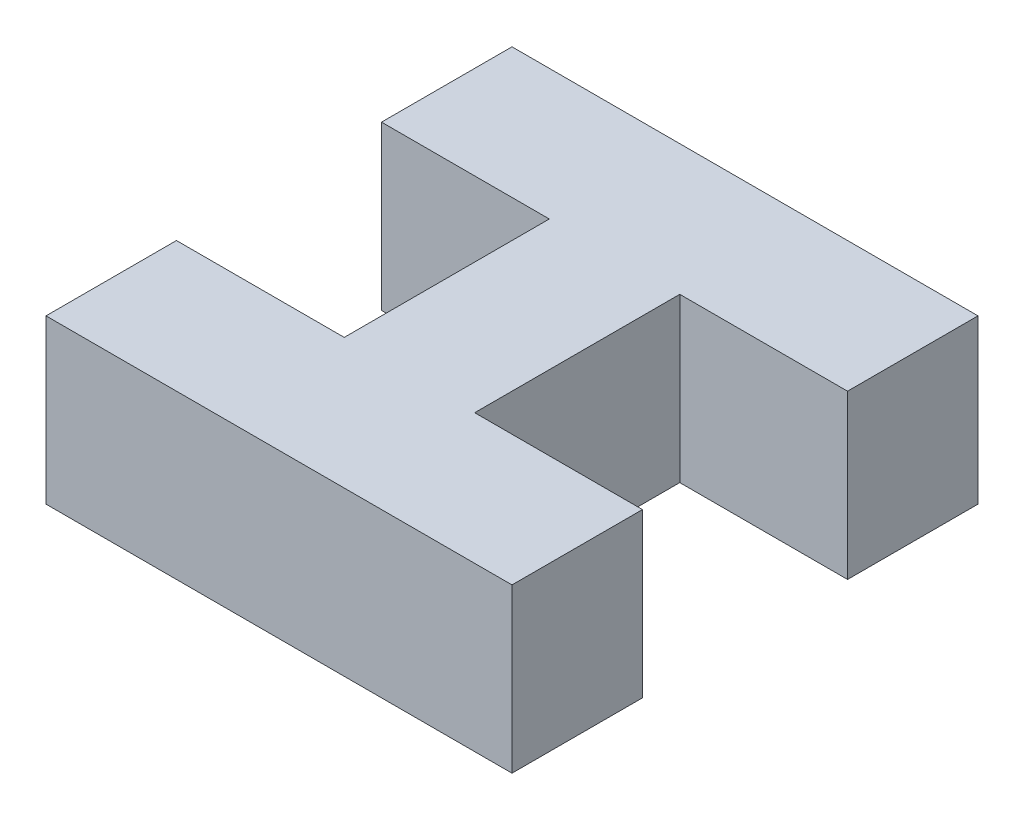
ISO-10303-21;
HEADER;
FILE_DESCRIPTION(('STEP AP214'),'2;1');
FILE_NAME('part.step','',(''),(''),'','','');
FILE_SCHEMA(('AUTOMOTIVE_DESIGN { 1 0 10303 214 1 1 1 1 }'));
ENDSEC;
DATA;
#1=APPLICATION_CONTEXT('core data for automotive mechanical design processes');
#2=APPLICATION_PROTOCOL_DEFINITION('international standard','automotive_design',2000,#1);
#3=PRODUCT_CONTEXT('',#1,'mechanical');
#4=PRODUCT('Part','Part','',(#3));
#5=PRODUCT_RELATED_PRODUCT_CATEGORY('part','',(#4));
#6=PRODUCT_DEFINITION_FORMATION('','',#4);
#7=PRODUCT_DEFINITION_CONTEXT('part definition',#1,'design');
#8=PRODUCT_DEFINITION('design','',#6,#7);
#9=PRODUCT_DEFINITION_SHAPE('','',#8);
#10=(LENGTH_UNIT() NAMED_UNIT(*) SI_UNIT(.MILLI.,.METRE.));
#11=(NAMED_UNIT(*) PLANE_ANGLE_UNIT() SI_UNIT($,.RADIAN.));
#12=(NAMED_UNIT(*) SI_UNIT($,.STERADIAN.) SOLID_ANGLE_UNIT());
#13=UNCERTAINTY_MEASURE_WITH_UNIT(LENGTH_MEASURE(1.E-05),#10,'distance_accuracy_value','');
#14=(GEOMETRIC_REPRESENTATION_CONTEXT(3) GLOBAL_UNCERTAINTY_ASSIGNED_CONTEXT((#13)) GLOBAL_UNIT_ASSIGNED_CONTEXT((#10,
#11,#12)) REPRESENTATION_CONTEXT('',''));
#15=CARTESIAN_POINT('',(0.,0.,0.));
#16=DIRECTION('',(0.,0.,1.));
#17=DIRECTION('',(1.,0.,0.));
#18=AXIS2_PLACEMENT_3D('',#15,#16,#17);
#19=CARTESIAN_POINT('',(7.14375,5.,-3.14375));
#20=DIRECTION('',(-1.,0.,0.));
#21=DIRECTION('',(0.,0.,1.));
#22=AXIS2_PLACEMENT_3D('',#19,#20,#21);
#23=PLANE('',#22);
#24=DIRECTION('',(0.,0.,-1.));
#25=VECTOR('',#24,1.);
#26=CARTESIAN_POINT('',(7.14375,0.,-3.14375));
#27=LINE('',#26,#25);
#28=CARTESIAN_POINT('',(7.14375,0.,-3.14375));
#29=VERTEX_POINT('',#28);
#30=CARTESIAN_POINT('',(7.14375,0.,-7.14375));
#31=VERTEX_POINT('',#30);
#32=EDGE_CURVE('E153',#29,#31,#27,.T.);
#33=ORIENTED_EDGE('',*,*,#32,.T.);
#34=DIRECTION('',(0.,-1.,0.));
#35=VECTOR('',#34,1.);
#36=CARTESIAN_POINT('',(7.14375,5.,-7.14375));
#37=LINE('',#36,#35);
#38=CARTESIAN_POINT('',(7.14375,5.,-7.14375));
#39=VERTEX_POINT('',#38);
#40=EDGE_CURVE('E11',#39,#31,#37,.T.);
#41=ORIENTED_EDGE('',*,*,#40,.F.);
#42=DIRECTION('',(0.,0.,-1.));
#43=VECTOR('',#42,1.);
#44=CARTESIAN_POINT('',(7.14375,5.,-3.14375));
#45=LINE('',#44,#43);
#46=CARTESIAN_POINT('',(7.14375,5.,-3.14375));
#47=VERTEX_POINT('',#46);
#48=EDGE_CURVE('E180',#47,#39,#45,.T.);
#49=ORIENTED_EDGE('',*,*,#48,.F.);
#50=DIRECTION('',(0.,-1.,0.));
#51=VECTOR('',#50,1.);
#52=CARTESIAN_POINT('',(7.14375,5.,-3.14375));
#53=LINE('',#52,#51);
#54=EDGE_CURVE('E149',#47,#29,#53,.T.);
#55=ORIENTED_EDGE('',*,*,#54,.T.);
#56=EDGE_LOOP('',(#33,#41,#49,#55));
#57=FACE_BOUND('',#56,.T.);
#58=ADVANCED_FACE('F33',(#57),#23,.F.);
#59=CARTESIAN_POINT('',(-7.14375,5.,-7.14375));
#60=DIRECTION('',(0.,0.,1.));
#61=DIRECTION('',(1.,0.,0.));
#62=AXIS2_PLACEMENT_3D('',#59,#60,#61);
#63=PLANE('',#62);
#64=DIRECTION('',(-1.,0.,0.));
#65=VECTOR('',#64,1.);
#66=CARTESIAN_POINT('',(-7.14375,0.,-7.14375));
#67=LINE('',#66,#65);
#68=CARTESIAN_POINT('',(-7.14375,0.,-7.14375));
#69=VERTEX_POINT('',#68);
#70=EDGE_CURVE('E156',#31,#69,#67,.T.);
#71=ORIENTED_EDGE('',*,*,#70,.T.);
#72=DIRECTION('',(0.,-1.,0.));
#73=VECTOR('',#72,1.);
#74=CARTESIAN_POINT('',(-7.14375,5.,-7.14375));
#75=LINE('',#74,#73);
#76=CARTESIAN_POINT('',(-7.14375,5.,-7.14375));
#77=VERTEX_POINT('',#76);
#78=EDGE_CURVE('E41',#77,#69,#75,.T.);
#79=ORIENTED_EDGE('',*,*,#78,.F.);
#80=DIRECTION('',(-1.,0.,0.));
#81=VECTOR('',#80,1.);
#82=CARTESIAN_POINT('',(-7.14375,5.,-7.14375));
#83=LINE('',#82,#81);
#84=EDGE_CURVE('E101',#39,#77,#83,.T.);
#85=ORIENTED_EDGE('',*,*,#84,.F.);
#86=ORIENTED_EDGE('',*,*,#40,.T.);
#87=EDGE_LOOP('',(#71,#79,#85,#86));
#88=FACE_BOUND('',#87,.T.);
#89=ADVANCED_FACE('F246',(#88),#63,.F.);
#90=CARTESIAN_POINT('',(-7.14375,5.,-3.14375));
#91=DIRECTION('',(1.,0.,0.));
#92=DIRECTION('',(0.,0.,-1.));
#93=AXIS2_PLACEMENT_3D('',#90,#91,#92);
#94=PLANE('',#93);
#95=DIRECTION('',(0.,0.,1.));
#96=VECTOR('',#95,1.);
#97=CARTESIAN_POINT('',(-7.14375,0.,-3.14375));
#98=LINE('',#97,#96);
#99=CARTESIAN_POINT('',(-7.14375,0.,-3.14375));
#100=VERTEX_POINT('',#99);
#101=EDGE_CURVE('E158',#69,#100,#98,.T.);
#102=ORIENTED_EDGE('',*,*,#101,.T.);
#103=DIRECTION('',(0.,-1.,0.));
#104=VECTOR('',#103,1.);
#105=CARTESIAN_POINT('',(-7.14375,5.,-3.14375));
#106=LINE('',#105,#104);
#107=CARTESIAN_POINT('',(-7.14375,5.,-3.14375));
#108=VERTEX_POINT('',#107);
#109=EDGE_CURVE('E199',#108,#100,#106,.T.);
#110=ORIENTED_EDGE('',*,*,#109,.F.);
#111=DIRECTION('',(0.,0.,1.));
#112=VECTOR('',#111,1.);
#113=CARTESIAN_POINT('',(-7.14375,5.,-3.14375));
#114=LINE('',#113,#112);
#115=EDGE_CURVE('E207',#77,#108,#114,.T.);
#116=ORIENTED_EDGE('',*,*,#115,.F.);
#117=ORIENTED_EDGE('',*,*,#78,.T.);
#118=EDGE_LOOP('',(#102,#110,#116,#117));
#119=FACE_BOUND('',#118,.T.);
#120=ADVANCED_FACE('F205',(#119),#94,.F.);
#121=CARTESIAN_POINT('',(-3.14375,5.,-3.14375));
#122=DIRECTION('',(0.,0.,-1.));
#123=DIRECTION('',(-1.,0.,0.));
#124=AXIS2_PLACEMENT_3D('',#121,#122,#123);
#125=PLANE('',#124);
#126=DIRECTION('',(1.,0.,0.));
#127=VECTOR('',#126,1.);
#128=CARTESIAN_POINT('',(-3.14375,0.,-3.14375));
#129=LINE('',#128,#127);
#130=CARTESIAN_POINT('',(-2.,0.,-3.14375));
#131=VERTEX_POINT('',#130);
#132=EDGE_CURVE('E161',#100,#131,#129,.T.);
#133=ORIENTED_EDGE('',*,*,#132,.T.);
#134=DIRECTION('',(0.,-1.,0.));
#135=VECTOR('',#134,1.);
#136=CARTESIAN_POINT('',(-2.,5.,-3.14375));
#137=LINE('',#136,#135);
#138=CARTESIAN_POINT('',(-2.,5.,-3.14375));
#139=VERTEX_POINT('',#138);
#140=EDGE_CURVE('E196',#139,#131,#137,.T.);
#141=ORIENTED_EDGE('',*,*,#140,.F.);
#142=DIRECTION('',(1.,0.,0.));
#143=VECTOR('',#142,1.);
#144=CARTESIAN_POINT('',(-3.14375,5.,-3.14375));
#145=LINE('',#144,#143);
#146=EDGE_CURVE('E220',#108,#139,#145,.T.);
#147=ORIENTED_EDGE('',*,*,#146,.F.);
#148=ORIENTED_EDGE('',*,*,#109,.T.);
#149=EDGE_LOOP('',(#133,#141,#147,#148));
#150=FACE_BOUND('',#149,.T.);
#151=ADVANCED_FACE('F211',(#150),#125,.F.);
#152=CARTESIAN_POINT('',(-2.,5.,2.));
#153=DIRECTION('',(1.,0.,0.));
#154=DIRECTION('',(0.,0.,-1.));
#155=AXIS2_PLACEMENT_3D('',#152,#153,#154);
#156=PLANE('',#155);
#157=DIRECTION('',(0.,0.,1.));
#158=VECTOR('',#157,1.);
#159=CARTESIAN_POINT('',(-2.,0.,2.));
#160=LINE('',#159,#158);
#161=CARTESIAN_POINT('',(-2.,0.,3.14375));
#162=VERTEX_POINT('',#161);
#163=EDGE_CURVE('E164',#131,#162,#160,.T.);
#164=ORIENTED_EDGE('',*,*,#163,.T.);
#165=DIRECTION('',(0.,-1.,0.));
#166=VECTOR('',#165,1.);
#167=CARTESIAN_POINT('',(-2.,5.,3.14375));
#168=LINE('',#167,#166);
#169=CARTESIAN_POINT('',(-2.,5.,3.14375));
#170=VERTEX_POINT('',#169);
#171=EDGE_CURVE('E193',#170,#162,#168,.T.);
#172=ORIENTED_EDGE('',*,*,#171,.F.);
#173=DIRECTION('',(0.,0.,1.));
#174=VECTOR('',#173,1.);
#175=CARTESIAN_POINT('',(-2.,5.,-2.));
#176=LINE('',#175,#174);
#177=EDGE_CURVE('E217',#139,#170,#176,.T.);
#178=ORIENTED_EDGE('',*,*,#177,.F.);
#179=ORIENTED_EDGE('',*,*,#140,.T.);
#180=EDGE_LOOP('',(#164,#172,#178,#179));
#181=FACE_BOUND('',#180,.T.);
#182=ADVANCED_FACE('F215',(#181),#156,.F.);
#183=CARTESIAN_POINT('',(-3.14375,5.,3.14375));
#184=DIRECTION('',(0.,0.,1.));
#185=DIRECTION('',(1.,0.,0.));
#186=AXIS2_PLACEMENT_3D('',#183,#184,#185);
#187=PLANE('',#186);
#188=DIRECTION('',(-1.,0.,0.));
#189=VECTOR('',#188,1.);
#190=CARTESIAN_POINT('',(-3.14375,0.,3.14375));
#191=LINE('',#190,#189);
#192=CARTESIAN_POINT('',(-7.14375,0.,3.14375));
#193=VERTEX_POINT('',#192);
#194=EDGE_CURVE('E167',#162,#193,#191,.T.);
#195=ORIENTED_EDGE('',*,*,#194,.T.);
#196=DIRECTION('',(0.,-1.,0.));
#197=VECTOR('',#196,1.);
#198=CARTESIAN_POINT('',(-7.14375,5.,3.14375));
#199=LINE('',#198,#197);
#200=CARTESIAN_POINT('',(-7.14375,5.,3.14375));
#201=VERTEX_POINT('',#200);
#202=EDGE_CURVE('E190',#201,#193,#199,.T.);
#203=ORIENTED_EDGE('',*,*,#202,.F.);
#204=DIRECTION('',(-1.,0.,0.));
#205=VECTOR('',#204,1.);
#206=CARTESIAN_POINT('',(-3.14375,5.,3.14375));
#207=LINE('',#206,#205);
#208=EDGE_CURVE('E219',#170,#201,#207,.T.);
#209=ORIENTED_EDGE('',*,*,#208,.F.);
#210=ORIENTED_EDGE('',*,*,#171,.T.);
#211=EDGE_LOOP('',(#195,#203,#209,#210));
#212=FACE_BOUND('',#211,.T.);
#213=ADVANCED_FACE('F258',(#212),#187,.F.);
#214=CARTESIAN_POINT('',(-7.14375,5.,7.14375));
#215=DIRECTION('',(1.,0.,0.));
#216=DIRECTION('',(0.,0.,-1.));
#217=AXIS2_PLACEMENT_3D('',#214,#215,#216);
#218=PLANE('',#217);
#219=DIRECTION('',(0.,0.,1.));
#220=VECTOR('',#219,1.);
#221=CARTESIAN_POINT('',(-7.14375,0.,7.14375));
#222=LINE('',#221,#220);
#223=CARTESIAN_POINT('',(-7.14375,0.,7.14375));
#224=VERTEX_POINT('',#223);
#225=EDGE_CURVE('E169',#193,#224,#222,.T.);
#226=ORIENTED_EDGE('',*,*,#225,.T.);
#227=DIRECTION('',(0.,-1.,0.));
#228=VECTOR('',#227,1.);
#229=CARTESIAN_POINT('',(-7.14375,5.,7.14375));
#230=LINE('',#229,#228);
#231=CARTESIAN_POINT('',(-7.14375,5.,7.14375));
#232=VERTEX_POINT('',#231);
#233=EDGE_CURVE('E187',#232,#224,#230,.T.);
#234=ORIENTED_EDGE('',*,*,#233,.F.);
#235=DIRECTION('',(0.,0.,1.));
#236=VECTOR('',#235,1.);
#237=CARTESIAN_POINT('',(-7.14375,5.,7.14375));
#238=LINE('',#237,#236);
#239=EDGE_CURVE('E222',#201,#232,#238,.T.);
#240=ORIENTED_EDGE('',*,*,#239,.F.);
#241=ORIENTED_EDGE('',*,*,#202,.T.);
#242=EDGE_LOOP('',(#226,#234,#240,#241));
#243=FACE_BOUND('',#242,.T.);
#244=ADVANCED_FACE('F261',(#243),#218,.F.);
#245=CARTESIAN_POINT('',(-7.14375,5.,7.14375));
#246=DIRECTION('',(0.,0.,-1.));
#247=DIRECTION('',(-1.,0.,0.));
#248=AXIS2_PLACEMENT_3D('',#245,#246,#247);
#249=PLANE('',#248);
#250=DIRECTION('',(1.,0.,0.));
#251=VECTOR('',#250,1.);
#252=CARTESIAN_POINT('',(-7.14375,0.,7.14375));
#253=LINE('',#252,#251);
#254=CARTESIAN_POINT('',(7.14375,0.,7.14375));
#255=VERTEX_POINT('',#254);
#256=EDGE_CURVE('E171',#224,#255,#253,.T.);
#257=ORIENTED_EDGE('',*,*,#256,.T.);
#258=DIRECTION('',(0.,-1.,0.));
#259=VECTOR('',#258,1.);
#260=CARTESIAN_POINT('',(7.14375,5.,7.14375));
#261=LINE('',#260,#259);
#262=CARTESIAN_POINT('',(7.14375,5.,7.14375));
#263=VERTEX_POINT('',#262);
#264=EDGE_CURVE('E184',#263,#255,#261,.T.);
#265=ORIENTED_EDGE('',*,*,#264,.F.);
#266=DIRECTION('',(1.,0.,0.));
#267=VECTOR('',#266,1.);
#268=CARTESIAN_POINT('',(-7.14375,5.,7.14375));
#269=LINE('',#268,#267);
#270=EDGE_CURVE('E228',#232,#263,#269,.T.);
#271=ORIENTED_EDGE('',*,*,#270,.F.);
#272=ORIENTED_EDGE('',*,*,#233,.T.);
#273=EDGE_LOOP('',(#257,#265,#271,#272));
#274=FACE_BOUND('',#273,.T.);
#275=ADVANCED_FACE('F234',(#274),#249,.F.);
#276=CARTESIAN_POINT('',(7.14375,5.,7.14375));
#277=DIRECTION('',(-1.,0.,0.));
#278=DIRECTION('',(0.,0.,1.));
#279=AXIS2_PLACEMENT_3D('',#276,#277,#278);
#280=PLANE('',#279);
#281=DIRECTION('',(0.,0.,-1.));
#282=VECTOR('',#281,1.);
#283=CARTESIAN_POINT('',(7.14375,0.,7.14375));
#284=LINE('',#283,#282);
#285=CARTESIAN_POINT('',(7.14375,0.,3.14375));
#286=VERTEX_POINT('',#285);
#287=EDGE_CURVE('E173',#255,#286,#284,.T.);
#288=ORIENTED_EDGE('',*,*,#287,.T.);
#289=DIRECTION('',(0.,-1.,0.));
#290=VECTOR('',#289,1.);
#291=CARTESIAN_POINT('',(7.14375,5.,3.14375));
#292=LINE('',#291,#290);
#293=CARTESIAN_POINT('',(7.14375,5.,3.14375));
#294=VERTEX_POINT('',#293);
#295=EDGE_CURVE('E144',#294,#286,#292,.T.);
#296=ORIENTED_EDGE('',*,*,#295,.F.);
#297=DIRECTION('',(0.,0.,-1.));
#298=VECTOR('',#297,1.);
#299=CARTESIAN_POINT('',(7.14375,5.,7.14375));
#300=LINE('',#299,#298);
#301=EDGE_CURVE('E133',#263,#294,#300,.T.);
#302=ORIENTED_EDGE('',*,*,#301,.F.);
#303=ORIENTED_EDGE('',*,*,#264,.T.);
#304=EDGE_LOOP('',(#288,#296,#302,#303));
#305=FACE_BOUND('',#304,.T.);
#306=ADVANCED_FACE('F238',(#305),#280,.F.);
#307=CARTESIAN_POINT('',(2.,5.,3.14375));
#308=DIRECTION('',(0.,0.,1.));
#309=DIRECTION('',(1.,0.,0.));
#310=AXIS2_PLACEMENT_3D('',#307,#308,#309);
#311=PLANE('',#310);
#312=DIRECTION('',(-1.,0.,0.));
#313=VECTOR('',#312,1.);
#314=CARTESIAN_POINT('',(2.,0.,3.14375));
#315=LINE('',#314,#313);
#316=CARTESIAN_POINT('',(2.,0.,3.14375));
#317=VERTEX_POINT('',#316);
#318=EDGE_CURVE('E142',#286,#317,#315,.T.);
#319=ORIENTED_EDGE('',*,*,#318,.T.);
#320=DIRECTION('',(0.,-1.,0.));
#321=VECTOR('',#320,1.);
#322=CARTESIAN_POINT('',(2.,5.,3.14375));
#323=LINE('',#322,#321);
#324=CARTESIAN_POINT('',(2.,5.,3.14375));
#325=VERTEX_POINT('',#324);
#326=EDGE_CURVE('E140',#325,#317,#323,.T.);
#327=ORIENTED_EDGE('',*,*,#326,.F.);
#328=DIRECTION('',(-1.,0.,0.));
#329=VECTOR('',#328,1.);
#330=CARTESIAN_POINT('',(3.14375,5.,3.14375));
#331=LINE('',#330,#329);
#332=EDGE_CURVE('E126',#294,#325,#331,.T.);
#333=ORIENTED_EDGE('',*,*,#332,.F.);
#334=ORIENTED_EDGE('',*,*,#295,.T.);
#335=EDGE_LOOP('',(#319,#327,#333,#334));
#336=FACE_BOUND('',#335,.T.);
#337=ADVANCED_FACE('F141',(#336),#311,.F.);
#338=CARTESIAN_POINT('',(2.,5.,-2.));
#339=DIRECTION('',(-1.,0.,0.));
#340=DIRECTION('',(0.,0.,1.));
#341=AXIS2_PLACEMENT_3D('',#338,#339,#340);
#342=PLANE('',#341);
#343=DIRECTION('',(0.,0.,-1.));
#344=VECTOR('',#343,1.);
#345=CARTESIAN_POINT('',(2.,0.,-2.));
#346=LINE('',#345,#344);
#347=CARTESIAN_POINT('',(2.,0.,-3.14375));
#348=VERTEX_POINT('',#347);
#349=EDGE_CURVE('E177',#317,#348,#346,.T.);
#350=ORIENTED_EDGE('',*,*,#349,.T.);
#351=DIRECTION('',(0.,-1.,0.));
#352=VECTOR('',#351,1.);
#353=CARTESIAN_POINT('',(2.,5.,-3.14375));
#354=LINE('',#353,#352);
#355=CARTESIAN_POINT('',(2.,5.,-3.14375));
#356=VERTEX_POINT('',#355);
#357=EDGE_CURVE('E145',#356,#348,#354,.T.);
#358=ORIENTED_EDGE('',*,*,#357,.F.);
#359=DIRECTION('',(0.,0.,-1.));
#360=VECTOR('',#359,1.);
#361=CARTESIAN_POINT('',(2.,5.,2.));
#362=LINE('',#361,#360);
#363=EDGE_CURVE('E130',#325,#356,#362,.T.);
#364=ORIENTED_EDGE('',*,*,#363,.F.);
#365=ORIENTED_EDGE('',*,*,#326,.T.);
#366=EDGE_LOOP('',(#350,#358,#364,#365));
#367=FACE_BOUND('',#366,.T.);
#368=ADVANCED_FACE('F147',(#367),#342,.F.);
#369=CARTESIAN_POINT('',(3.14375,5.,-3.14375));
#370=DIRECTION('',(0.,0.,-1.));
#371=DIRECTION('',(-1.,0.,0.));
#372=AXIS2_PLACEMENT_3D('',#369,#370,#371);
#373=PLANE('',#372);
#374=DIRECTION('',(1.,0.,0.));
#375=VECTOR('',#374,1.);
#376=CARTESIAN_POINT('',(3.14375,0.,-3.14375));
#377=LINE('',#376,#375);
#378=EDGE_CURVE('E89',#348,#29,#377,.T.);
#379=ORIENTED_EDGE('',*,*,#378,.T.);
#380=ORIENTED_EDGE('',*,*,#54,.F.);
#381=DIRECTION('',(1.,0.,0.));
#382=VECTOR('',#381,1.);
#383=CARTESIAN_POINT('',(2.,5.,-3.14375));
#384=LINE('',#383,#382);
#385=EDGE_CURVE('E49',#356,#47,#384,.T.);
#386=ORIENTED_EDGE('',*,*,#385,.F.);
#387=ORIENTED_EDGE('',*,*,#357,.T.);
#388=EDGE_LOOP('',(#379,#380,#386,#387));
#389=FACE_BOUND('',#388,.T.);
#390=ADVANCED_FACE('F240',(#389),#373,.F.);
#391=CARTESIAN_POINT('',(0.,5.,0.));
#392=DIRECTION('',(0.,-1.,0.));
#393=DIRECTION('',(0.,0.,-1.));
#394=AXIS2_PLACEMENT_3D('',#391,#392,#393);
#395=PLANE('',#394);
#396=ORIENTED_EDGE('',*,*,#48,.T.);
#397=ORIENTED_EDGE('',*,*,#84,.T.);
#398=ORIENTED_EDGE('',*,*,#115,.T.);
#399=ORIENTED_EDGE('',*,*,#146,.T.);
#400=ORIENTED_EDGE('',*,*,#177,.T.);
#401=ORIENTED_EDGE('',*,*,#208,.T.);
#402=ORIENTED_EDGE('',*,*,#239,.T.);
#403=ORIENTED_EDGE('',*,*,#270,.T.);
#404=ORIENTED_EDGE('',*,*,#301,.T.);
#405=ORIENTED_EDGE('',*,*,#332,.T.);
#406=ORIENTED_EDGE('',*,*,#363,.T.);
#407=ORIENTED_EDGE('',*,*,#385,.T.);
#408=EDGE_LOOP('',(#396,#397,#398,#399,#400,#401,#402,#403,#404,#405,#406,#407));
#409=FACE_BOUND('',#408,.T.);
#410=ADVANCED_FACE('F128',(#409),#395,.F.);
#411=CARTESIAN_POINT('',(0.,0.,0.));
#412=DIRECTION('',(0.,-1.,0.));
#413=DIRECTION('',(0.,0.,-1.));
#414=AXIS2_PLACEMENT_3D('',#411,#412,#413);
#415=PLANE('',#414);
#416=ORIENTED_EDGE('',*,*,#32,.F.);
#417=ORIENTED_EDGE('',*,*,#378,.F.);
#418=ORIENTED_EDGE('',*,*,#349,.F.);
#419=ORIENTED_EDGE('',*,*,#318,.F.);
#420=ORIENTED_EDGE('',*,*,#287,.F.);
#421=ORIENTED_EDGE('',*,*,#256,.F.);
#422=ORIENTED_EDGE('',*,*,#225,.F.);
#423=ORIENTED_EDGE('',*,*,#194,.F.);
#424=ORIENTED_EDGE('',*,*,#163,.F.);
#425=ORIENTED_EDGE('',*,*,#132,.F.);
#426=ORIENTED_EDGE('',*,*,#101,.F.);
#427=ORIENTED_EDGE('',*,*,#70,.F.);
#428=EDGE_LOOP('',(#416,#417,#418,#419,#420,#421,#422,#423,#424,#425,#426,#427));
#429=FACE_BOUND('',#428,.T.);
#430=ADVANCED_FACE('F208',(#429),#415,.T.);
#431=CLOSED_SHELL('',(#58,#89,#120,#151,#182,#213,#244,#275,#306,#337,#368,#390,#410,#430));
#432=MANIFOLD_SOLID_BREP('B2',#431);
#433=ADVANCED_BREP_SHAPE_REPRESENTATION('',(#18,#432),#14);
#434=SHAPE_DEFINITION_REPRESENTATION(#9,#433);
ENDSEC;
END-ISO-10303-21;
